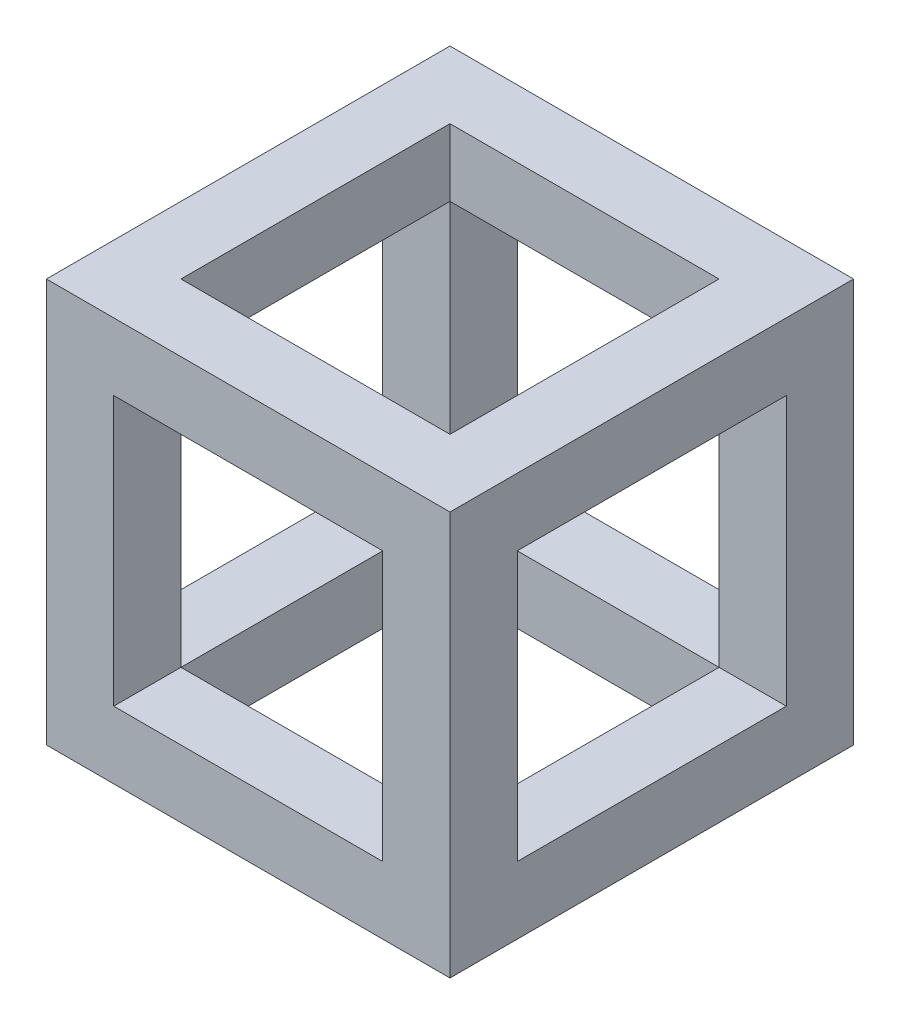
ISO-10303-21;
HEADER;
FILE_DESCRIPTION(('STEP AP214'),'2;1');
FILE_NAME('part.step','',(''),(''),'','','');
FILE_SCHEMA(('AUTOMOTIVE_DESIGN { 1 0 10303 214 1 1 1 1 }'));
ENDSEC;
DATA;
#1=APPLICATION_CONTEXT('core data for automotive mechanical design processes');
#2=APPLICATION_PROTOCOL_DEFINITION('international standard','automotive_design',2000,#1);
#3=PRODUCT_CONTEXT('',#1,'mechanical');
#4=PRODUCT('Part','Part','',(#3));
#5=PRODUCT_RELATED_PRODUCT_CATEGORY('part','',(#4));
#6=PRODUCT_DEFINITION_FORMATION('','',#4);
#7=PRODUCT_DEFINITION_CONTEXT('part definition',#1,'design');
#8=PRODUCT_DEFINITION('design','',#6,#7);
#9=PRODUCT_DEFINITION_SHAPE('','',#8);
#10=(LENGTH_UNIT() NAMED_UNIT(*) SI_UNIT(.MILLI.,.METRE.));
#11=(NAMED_UNIT(*) PLANE_ANGLE_UNIT() SI_UNIT($,.RADIAN.));
#12=(NAMED_UNIT(*) SI_UNIT($,.STERADIAN.) SOLID_ANGLE_UNIT());
#13=UNCERTAINTY_MEASURE_WITH_UNIT(LENGTH_MEASURE(1.E-05),#10,'distance_accuracy_value','');
#14=(GEOMETRIC_REPRESENTATION_CONTEXT(3) GLOBAL_UNCERTAINTY_ASSIGNED_CONTEXT((#13)) GLOBAL_UNIT_ASSIGNED_CONTEXT((#10,
#11,#12)) REPRESENTATION_CONTEXT('',''));
#15=CARTESIAN_POINT('',(0.,0.,0.));
#16=DIRECTION('',(0.,0.,1.));
#17=DIRECTION('',(1.,0.,0.));
#18=AXIS2_PLACEMENT_3D('',#15,#16,#17);
#19=CARTESIAN_POINT('',(5.,0.,5.));
#20=DIRECTION('',(-1.,0.,0.));
#21=DIRECTION('',(0.,0.,1.));
#22=AXIS2_PLACEMENT_3D('',#19,#20,#21);
#23=PLANE('',#22);
#24=DIRECTION('',(0.,0.,1.));
#25=VECTOR('',#24,1.);
#26=CARTESIAN_POINT('',(5.,5.,0.));
#27=LINE('',#26,#25);
#28=CARTESIAN_POINT('',(5.,5.,25.));
#29=VERTEX_POINT('',#28);
#30=CARTESIAN_POINT('',(5.,5.,30.));
#31=VERTEX_POINT('',#30);
#32=EDGE_CURVE('E249',#29,#31,#27,.T.);
#33=ORIENTED_EDGE('',*,*,#32,.F.);
#34=DIRECTION('',(0.,1.,0.));
#35=VECTOR('',#34,1.);
#36=CARTESIAN_POINT('',(5.,0.,25.));
#37=LINE('',#36,#35);
#38=CARTESIAN_POINT('',(5.,25.,25.));
#39=VERTEX_POINT('',#38);
#40=EDGE_CURVE('E180',#29,#39,#37,.T.);
#41=ORIENTED_EDGE('',*,*,#40,.T.);
#42=DIRECTION('',(0.,0.,1.));
#43=VECTOR('',#42,1.);
#44=CARTESIAN_POINT('',(5.,25.,0.));
#45=LINE('',#44,#43);
#46=CARTESIAN_POINT('',(5.,25.,30.));
#47=VERTEX_POINT('',#46);
#48=EDGE_CURVE('E263',#39,#47,#45,.T.);
#49=ORIENTED_EDGE('',*,*,#48,.T.);
#50=DIRECTION('',(0.,-1.,0.));
#51=VECTOR('',#50,1.);
#52=CARTESIAN_POINT('',(5.,5.,30.));
#53=LINE('',#52,#51);
#54=EDGE_CURVE('E235',#47,#31,#53,.T.);
#55=ORIENTED_EDGE('',*,*,#54,.T.);
#56=EDGE_LOOP('',(#33,#41,#49,#55));
#57=FACE_BOUND('',#56,.T.);
#58=ADVANCED_FACE('F33',(#57),#23,.F.);
#59=DIRECTION('',(0.,1.,0.));
#60=VECTOR('',#59,1.);
#61=CARTESIAN_POINT('',(5.,0.,25.));
#62=LINE('',#61,#60);
#63=CARTESIAN_POINT('',(5.,30.,25.));
#64=VERTEX_POINT('',#63);
#65=EDGE_CURVE('E294',#39,#64,#62,.T.);
#66=ORIENTED_EDGE('',*,*,#65,.F.);
#67=DIRECTION('',(0.,0.,-1.));
#68=VECTOR('',#67,1.);
#69=CARTESIAN_POINT('',(5.,25.,5.));
#70=LINE('',#69,#68);
#71=CARTESIAN_POINT('',(5.,25.,5.));
#72=VERTEX_POINT('',#71);
#73=EDGE_CURVE('E232',#39,#72,#70,.T.);
#74=ORIENTED_EDGE('',*,*,#73,.T.);
#75=DIRECTION('',(0.,1.,0.));
#76=VECTOR('',#75,1.);
#77=CARTESIAN_POINT('',(5.,0.,5.));
#78=LINE('',#77,#76);
#79=CARTESIAN_POINT('',(5.,30.,5.));
#80=VERTEX_POINT('',#79);
#81=EDGE_CURVE('E309',#72,#80,#78,.T.);
#82=ORIENTED_EDGE('',*,*,#81,.T.);
#83=DIRECTION('',(0.,0.,1.));
#84=VECTOR('',#83,1.);
#85=CARTESIAN_POINT('',(5.,30.,5.));
#86=LINE('',#85,#84);
#87=EDGE_CURVE('E280',#80,#64,#86,.T.);
#88=ORIENTED_EDGE('',*,*,#87,.T.);
#89=EDGE_LOOP('',(#66,#74,#82,#88));
#90=FACE_BOUND('',#89,.T.);
#91=ADVANCED_FACE('F362',(#90),#23,.F.);
#92=CARTESIAN_POINT('',(5.,25.,0.));
#93=VERTEX_POINT('',#92);
#94=EDGE_CURVE('E259',#93,#72,#45,.T.);
#95=ORIENTED_EDGE('',*,*,#94,.T.);
#96=DIRECTION('',(0.,-1.,0.));
#97=VECTOR('',#96,1.);
#98=CARTESIAN_POINT('',(5.,0.,5.));
#99=LINE('',#98,#97);
#100=CARTESIAN_POINT('',(5.,5.,5.));
#101=VERTEX_POINT('',#100);
#102=EDGE_CURVE('E220',#72,#101,#99,.T.);
#103=ORIENTED_EDGE('',*,*,#102,.T.);
#104=CARTESIAN_POINT('',(5.,5.,0.));
#105=VERTEX_POINT('',#104);
#106=EDGE_CURVE('E272',#105,#101,#27,.T.);
#107=ORIENTED_EDGE('',*,*,#106,.F.);
#108=DIRECTION('',(0.,-1.,0.));
#109=VECTOR('',#108,1.);
#110=CARTESIAN_POINT('',(5.,5.,0.));
#111=LINE('',#110,#109);
#112=EDGE_CURVE('E236',#93,#105,#111,.T.);
#113=ORIENTED_EDGE('',*,*,#112,.F.);
#114=EDGE_LOOP('',(#95,#103,#107,#113));
#115=FACE_BOUND('',#114,.T.);
#116=ADVANCED_FACE('F413',(#115),#23,.F.);
#117=CARTESIAN_POINT('',(25.,0.,5.));
#118=DIRECTION('',(1.,0.,0.));
#119=DIRECTION('',(0.,0.,-1.));
#120=AXIS2_PLACEMENT_3D('',#117,#118,#119);
#121=PLANE('',#120);
#122=DIRECTION('',(0.,0.,1.));
#123=VECTOR('',#122,1.);
#124=CARTESIAN_POINT('',(25.,25.,0.));
#125=LINE('',#124,#123);
#126=CARTESIAN_POINT('',(25.,25.,25.));
#127=VERTEX_POINT('',#126);
#128=CARTESIAN_POINT('',(25.,25.,30.));
#129=VERTEX_POINT('',#128);
#130=EDGE_CURVE('E267',#127,#129,#125,.T.);
#131=ORIENTED_EDGE('',*,*,#130,.F.);
#132=DIRECTION('',(0.,-1.,0.));
#133=VECTOR('',#132,1.);
#134=CARTESIAN_POINT('',(25.,0.,25.));
#135=LINE('',#134,#133);
#136=CARTESIAN_POINT('',(25.,5.,25.));
#137=VERTEX_POINT('',#136);
#138=EDGE_CURVE('E223',#127,#137,#135,.T.);
#139=ORIENTED_EDGE('',*,*,#138,.T.);
#140=DIRECTION('',(0.,0.,1.));
#141=VECTOR('',#140,1.);
#142=CARTESIAN_POINT('',(25.,5.,0.));
#143=LINE('',#142,#141);
#144=CARTESIAN_POINT('',(25.,5.,30.));
#145=VERTEX_POINT('',#144);
#146=EDGE_CURVE('E271',#137,#145,#143,.T.);
#147=ORIENTED_EDGE('',*,*,#146,.T.);
#148=DIRECTION('',(0.,1.,0.));
#149=VECTOR('',#148,1.);
#150=CARTESIAN_POINT('',(25.,5.,30.));
#151=LINE('',#150,#149);
#152=EDGE_CURVE('E254',#145,#129,#151,.T.);
#153=ORIENTED_EDGE('',*,*,#152,.T.);
#154=EDGE_LOOP('',(#131,#139,#147,#153));
#155=FACE_BOUND('',#154,.T.);
#156=ADVANCED_FACE('F426',(#155),#121,.F.);
#157=DIRECTION('',(0.,1.,0.));
#158=VECTOR('',#157,1.);
#159=CARTESIAN_POINT('',(25.,0.,5.));
#160=LINE('',#159,#158);
#161=CARTESIAN_POINT('',(25.,25.,5.));
#162=VERTEX_POINT('',#161);
#163=CARTESIAN_POINT('',(25.,30.,5.));
#164=VERTEX_POINT('',#163);
#165=EDGE_CURVE('E313',#162,#164,#160,.T.);
#166=ORIENTED_EDGE('',*,*,#165,.F.);
#167=DIRECTION('',(0.,0.,1.));
#168=VECTOR('',#167,1.);
#169=CARTESIAN_POINT('',(25.,25.,5.));
#170=LINE('',#169,#168);
#171=EDGE_CURVE('E11',#162,#127,#170,.T.);
#172=ORIENTED_EDGE('',*,*,#171,.T.);
#173=DIRECTION('',(0.,1.,0.));
#174=VECTOR('',#173,1.);
#175=CARTESIAN_POINT('',(25.,0.,25.));
#176=LINE('',#175,#174);
#177=CARTESIAN_POINT('',(25.,30.,25.));
#178=VERTEX_POINT('',#177);
#179=EDGE_CURVE('E317',#127,#178,#176,.T.);
#180=ORIENTED_EDGE('',*,*,#179,.T.);
#181=DIRECTION('',(0.,0.,-1.));
#182=VECTOR('',#181,1.);
#183=CARTESIAN_POINT('',(25.,30.,5.));
#184=LINE('',#183,#182);
#185=EDGE_CURVE('E300',#178,#164,#184,.T.);
#186=ORIENTED_EDGE('',*,*,#185,.T.);
#187=EDGE_LOOP('',(#166,#172,#180,#186));
#188=FACE_BOUND('',#187,.T.);
#189=ADVANCED_FACE('F374',(#188),#121,.F.);
#190=CARTESIAN_POINT('',(25.,5.,0.));
#191=VERTEX_POINT('',#190);
#192=CARTESIAN_POINT('',(25.,5.,5.));
#193=VERTEX_POINT('',#192);
#194=EDGE_CURVE('E268',#191,#193,#143,.T.);
#195=ORIENTED_EDGE('',*,*,#194,.T.);
#196=DIRECTION('',(0.,1.,0.));
#197=VECTOR('',#196,1.);
#198=CARTESIAN_POINT('',(25.,0.,5.));
#199=LINE('',#198,#197);
#200=EDGE_CURVE('E211',#193,#162,#199,.T.);
#201=ORIENTED_EDGE('',*,*,#200,.T.);
#202=CARTESIAN_POINT('',(25.,25.,0.));
#203=VERTEX_POINT('',#202);
#204=EDGE_CURVE('E264',#203,#162,#125,.T.);
#205=ORIENTED_EDGE('',*,*,#204,.F.);
#206=DIRECTION('',(0.,1.,0.));
#207=VECTOR('',#206,1.);
#208=CARTESIAN_POINT('',(25.,5.,0.));
#209=LINE('',#208,#207);
#210=EDGE_CURVE('E243',#191,#203,#209,.T.);
#211=ORIENTED_EDGE('',*,*,#210,.F.);
#212=EDGE_LOOP('',(#195,#201,#205,#211));
#213=FACE_BOUND('',#212,.T.);
#214=ADVANCED_FACE('F385',(#213),#121,.F.);
#215=CARTESIAN_POINT('',(5.,0.,5.));
#216=DIRECTION('',(0.,0.,-1.));
#217=DIRECTION('',(-1.,0.,0.));
#218=AXIS2_PLACEMENT_3D('',#215,#216,#217);
#219=PLANE('',#218);
#220=ORIENTED_EDGE('',*,*,#81,.F.);
#221=DIRECTION('',(1.,0.,0.));
#222=VECTOR('',#221,1.);
#223=CARTESIAN_POINT('',(5.,25.,5.));
#224=LINE('',#223,#222);
#225=EDGE_CURVE('E277',#72,#162,#224,.T.);
#226=ORIENTED_EDGE('',*,*,#225,.T.);
#227=ORIENTED_EDGE('',*,*,#165,.T.);
#228=DIRECTION('',(-1.,0.,0.));
#229=VECTOR('',#228,1.);
#230=CARTESIAN_POINT('',(5.,30.,5.));
#231=LINE('',#230,#229);
#232=EDGE_CURVE('E285',#164,#80,#231,.T.);
#233=ORIENTED_EDGE('',*,*,#232,.T.);
#234=EDGE_LOOP('',(#220,#226,#227,#233));
#235=FACE_BOUND('',#234,.T.);
#236=ADVANCED_FACE('F391',(#235),#219,.F.);
#237=CARTESIAN_POINT('',(5.,0.,25.));
#238=DIRECTION('',(0.,0.,1.));
#239=DIRECTION('',(1.,0.,0.));
#240=AXIS2_PLACEMENT_3D('',#237,#238,#239);
#241=PLANE('',#240);
#242=ORIENTED_EDGE('',*,*,#179,.F.);
#243=DIRECTION('',(-1.,0.,0.));
#244=VECTOR('',#243,1.);
#245=CARTESIAN_POINT('',(5.,25.,25.));
#246=LINE('',#245,#244);
#247=EDGE_CURVE('E41',#127,#39,#246,.T.);
#248=ORIENTED_EDGE('',*,*,#247,.T.);
#249=ORIENTED_EDGE('',*,*,#65,.T.);
#250=DIRECTION('',(1.,0.,0.));
#251=VECTOR('',#250,1.);
#252=CARTESIAN_POINT('',(5.,30.,25.));
#253=LINE('',#252,#251);
#254=EDGE_CURVE('E297',#64,#178,#253,.T.);
#255=ORIENTED_EDGE('',*,*,#254,.T.);
#256=EDGE_LOOP('',(#242,#248,#249,#255));
#257=FACE_BOUND('',#256,.T.);
#258=ADVANCED_FACE('F357',(#257),#241,.F.);
#259=CARTESIAN_POINT('',(0.,0.,30.));
#260=DIRECTION('',(1.,0.,0.));
#261=DIRECTION('',(0.,0.,-1.));
#262=AXIS2_PLACEMENT_3D('',#259,#260,#261);
#263=PLANE('',#262);
#264=DIRECTION('',(0.,0.,1.));
#265=VECTOR('',#264,1.);
#266=CARTESIAN_POINT('',(0.,25.,25.));
#267=LINE('',#266,#265);
#268=CARTESIAN_POINT('',(0.,25.,5.));
#269=VERTEX_POINT('',#268);
#270=CARTESIAN_POINT('',(0.,25.,25.));
#271=VERTEX_POINT('',#270);
#272=EDGE_CURVE('E194',#269,#271,#267,.T.);
#273=ORIENTED_EDGE('',*,*,#272,.T.);
#274=DIRECTION('',(0.,-1.,0.));
#275=VECTOR('',#274,1.);
#276=CARTESIAN_POINT('',(0.,5.,25.));
#277=LINE('',#276,#275);
#278=CARTESIAN_POINT('',(0.,5.,25.));
#279=VERTEX_POINT('',#278);
#280=EDGE_CURVE('E177',#271,#279,#277,.T.);
#281=ORIENTED_EDGE('',*,*,#280,.T.);
#282=DIRECTION('',(0.,0.,-1.));
#283=VECTOR('',#282,1.);
#284=CARTESIAN_POINT('',(0.,5.,25.));
#285=LINE('',#284,#283);
#286=CARTESIAN_POINT('',(0.,5.,5.));
#287=VERTEX_POINT('',#286);
#288=EDGE_CURVE('E187',#279,#287,#285,.T.);
#289=ORIENTED_EDGE('',*,*,#288,.T.);
#290=DIRECTION('',(0.,1.,0.));
#291=VECTOR('',#290,1.);
#292=CARTESIAN_POINT('',(0.,5.,5.));
#293=LINE('',#292,#291);
#294=EDGE_CURVE('E48',#287,#269,#293,.T.);
#295=ORIENTED_EDGE('',*,*,#294,.T.);
#296=EDGE_LOOP('',(#273,#281,#289,#295));
#297=FACE_BOUND('',#296,.T.);
#298=DIRECTION('',(0.,-1.,0.));
#299=VECTOR('',#298,1.);
#300=CARTESIAN_POINT('',(0.,0.,0.));
#301=LINE('',#300,#299);
#302=CARTESIAN_POINT('',(0.,30.,0.));
#303=VERTEX_POINT('',#302);
#304=CARTESIAN_POINT('',(0.,0.,0.));
#305=VERTEX_POINT('',#304);
#306=EDGE_CURVE('E308',#303,#305,#301,.T.);
#307=ORIENTED_EDGE('',*,*,#306,.T.);
#308=DIRECTION('',(0.,0.,-1.));
#309=VECTOR('',#308,1.);
#310=CARTESIAN_POINT('',(0.,0.,30.));
#311=LINE('',#310,#309);
#312=CARTESIAN_POINT('',(0.,0.,30.));
#313=VERTEX_POINT('',#312);
#314=EDGE_CURVE('E347',#313,#305,#311,.T.);
#315=ORIENTED_EDGE('',*,*,#314,.F.);
#316=DIRECTION('',(0.,-1.,0.));
#317=VECTOR('',#316,1.);
#318=CARTESIAN_POINT('',(0.,0.,30.));
#319=LINE('',#318,#317);
#320=CARTESIAN_POINT('',(0.,30.,30.));
#321=VERTEX_POINT('',#320);
#322=EDGE_CURVE('E321',#321,#313,#319,.T.);
#323=ORIENTED_EDGE('',*,*,#322,.F.);
#324=DIRECTION('',(0.,0.,-1.));
#325=VECTOR('',#324,1.);
#326=CARTESIAN_POINT('',(0.,30.,30.));
#327=LINE('',#326,#325);
#328=EDGE_CURVE('E331',#321,#303,#327,.T.);
#329=ORIENTED_EDGE('',*,*,#328,.T.);
#330=EDGE_LOOP('',(#307,#315,#323,#329));
#331=FACE_BOUND('',#330,.T.);
#332=ADVANCED_FACE('F35',(#297,#331),#263,.F.);
#333=CARTESIAN_POINT('',(0.,0.,30.));
#334=DIRECTION('',(0.,1.,0.));
#335=DIRECTION('',(0.,0.,1.));
#336=AXIS2_PLACEMENT_3D('',#333,#334,#335);
#337=PLANE('',#336);
#338=DIRECTION('',(-1.,0.,0.));
#339=VECTOR('',#338,1.);
#340=CARTESIAN_POINT('',(5.,0.,5.));
#341=LINE('',#340,#339);
#342=CARTESIAN_POINT('',(25.,0.,5.));
#343=VERTEX_POINT('',#342);
#344=CARTESIAN_POINT('',(5.,0.,5.));
#345=VERTEX_POINT('',#344);
#346=EDGE_CURVE('E291',#343,#345,#341,.T.);
#347=ORIENTED_EDGE('',*,*,#346,.T.);
#348=DIRECTION('',(0.,0.,1.));
#349=VECTOR('',#348,1.);
#350=CARTESIAN_POINT('',(5.,0.,5.));
#351=LINE('',#350,#349);
#352=CARTESIAN_POINT('',(5.,0.,25.));
#353=VERTEX_POINT('',#352);
#354=EDGE_CURVE('E281',#345,#353,#351,.T.);
#355=ORIENTED_EDGE('',*,*,#354,.T.);
#356=DIRECTION('',(1.,0.,0.));
#357=VECTOR('',#356,1.);
#358=CARTESIAN_POINT('',(5.,0.,25.));
#359=LINE('',#358,#357);
#360=CARTESIAN_POINT('',(25.,0.,25.));
#361=VERTEX_POINT('',#360);
#362=EDGE_CURVE('E284',#353,#361,#359,.T.);
#363=ORIENTED_EDGE('',*,*,#362,.T.);
#364=DIRECTION('',(0.,0.,-1.));
#365=VECTOR('',#364,1.);
#366=CARTESIAN_POINT('',(25.,0.,5.));
#367=LINE('',#366,#365);
#368=EDGE_CURVE('E288',#361,#343,#367,.T.);
#369=ORIENTED_EDGE('',*,*,#368,.T.);
#370=EDGE_LOOP('',(#347,#355,#363,#369));
#371=FACE_BOUND('',#370,.T.);
#372=DIRECTION('',(1.,0.,0.));
#373=VECTOR('',#372,1.);
#374=CARTESIAN_POINT('',(0.,0.,0.));
#375=LINE('',#374,#373);
#376=CARTESIAN_POINT('',(30.,0.,0.));
#377=VERTEX_POINT('',#376);
#378=EDGE_CURVE('E334',#305,#377,#375,.T.);
#379=ORIENTED_EDGE('',*,*,#378,.T.);
#380=DIRECTION('',(0.,0.,-1.));
#381=VECTOR('',#380,1.);
#382=CARTESIAN_POINT('',(30.,0.,30.));
#383=LINE('',#382,#381);
#384=CARTESIAN_POINT('',(30.,0.,30.));
#385=VERTEX_POINT('',#384);
#386=EDGE_CURVE('E344',#385,#377,#383,.T.);
#387=ORIENTED_EDGE('',*,*,#386,.F.);
#388=DIRECTION('',(1.,0.,0.));
#389=VECTOR('',#388,1.);
#390=CARTESIAN_POINT('',(0.,0.,30.));
#391=LINE('',#390,#389);
#392=EDGE_CURVE('E324',#313,#385,#391,.T.);
#393=ORIENTED_EDGE('',*,*,#392,.F.);
#394=ORIENTED_EDGE('',*,*,#314,.T.);
#395=EDGE_LOOP('',(#379,#387,#393,#394));
#396=FACE_BOUND('',#395,.T.);
#397=ADVANCED_FACE('F443',(#371,#396),#337,.F.);
#398=CARTESIAN_POINT('',(30.,0.,30.));
#399=DIRECTION('',(-1.,0.,0.));
#400=DIRECTION('',(0.,0.,1.));
#401=AXIS2_PLACEMENT_3D('',#398,#399,#400);
#402=PLANE('',#401);
#403=DIRECTION('',(0.,0.,-1.));
#404=VECTOR('',#403,1.);
#405=CARTESIAN_POINT('',(30.,5.,25.));
#406=LINE('',#405,#404);
#407=CARTESIAN_POINT('',(30.,5.,25.));
#408=VERTEX_POINT('',#407);
#409=CARTESIAN_POINT('',(30.,5.,5.));
#410=VERTEX_POINT('',#409);
#411=EDGE_CURVE('E204',#408,#410,#406,.T.);
#412=ORIENTED_EDGE('',*,*,#411,.F.);
#413=DIRECTION('',(0.,-1.,0.));
#414=VECTOR('',#413,1.);
#415=CARTESIAN_POINT('',(30.,5.,25.));
#416=LINE('',#415,#414);
#417=CARTESIAN_POINT('',(30.,25.,25.));
#418=VERTEX_POINT('',#417);
#419=EDGE_CURVE('E56',#418,#408,#416,.T.);
#420=ORIENTED_EDGE('',*,*,#419,.F.);
#421=DIRECTION('',(0.,0.,1.));
#422=VECTOR('',#421,1.);
#423=CARTESIAN_POINT('',(30.,25.,25.));
#424=LINE('',#423,#422);
#425=CARTESIAN_POINT('',(30.,25.,5.));
#426=VERTEX_POINT('',#425);
#427=EDGE_CURVE('E195',#426,#418,#424,.T.);
#428=ORIENTED_EDGE('',*,*,#427,.F.);
#429=DIRECTION('',(0.,1.,0.));
#430=VECTOR('',#429,1.);
#431=CARTESIAN_POINT('',(30.,5.,5.));
#432=LINE('',#431,#430);
#433=EDGE_CURVE('E198',#410,#426,#432,.T.);
#434=ORIENTED_EDGE('',*,*,#433,.F.);
#435=EDGE_LOOP('',(#412,#420,#428,#434));
#436=FACE_BOUND('',#435,.T.);
#437=DIRECTION('',(0.,1.,0.));
#438=VECTOR('',#437,1.);
#439=CARTESIAN_POINT('',(30.,0.,0.));
#440=LINE('',#439,#438);
#441=CARTESIAN_POINT('',(30.,30.,0.));
#442=VERTEX_POINT('',#441);
#443=EDGE_CURVE('E336',#377,#442,#440,.T.);
#444=ORIENTED_EDGE('',*,*,#443,.T.);
#445=DIRECTION('',(0.,0.,-1.));
#446=VECTOR('',#445,1.);
#447=CARTESIAN_POINT('',(30.,30.,30.));
#448=LINE('',#447,#446);
#449=CARTESIAN_POINT('',(30.,30.,30.));
#450=VERTEX_POINT('',#449);
#451=EDGE_CURVE('E341',#450,#442,#448,.T.);
#452=ORIENTED_EDGE('',*,*,#451,.F.);
#453=DIRECTION('',(0.,1.,0.));
#454=VECTOR('',#453,1.);
#455=CARTESIAN_POINT('',(30.,0.,30.));
#456=LINE('',#455,#454);
#457=EDGE_CURVE('E327',#385,#450,#456,.T.);
#458=ORIENTED_EDGE('',*,*,#457,.F.);
#459=ORIENTED_EDGE('',*,*,#386,.T.);
#460=EDGE_LOOP('',(#444,#452,#458,#459));
#461=FACE_BOUND('',#460,.T.);
#462=ADVANCED_FACE('F463',(#436,#461),#402,.F.);
#463=CARTESIAN_POINT('',(0.,30.,30.));
#464=DIRECTION('',(0.,-1.,0.));
#465=DIRECTION('',(0.,0.,-1.));
#466=AXIS2_PLACEMENT_3D('',#463,#464,#465);
#467=PLANE('',#466);
#468=ORIENTED_EDGE('',*,*,#254,.F.);
#469=ORIENTED_EDGE('',*,*,#87,.F.);
#470=ORIENTED_EDGE('',*,*,#232,.F.);
#471=ORIENTED_EDGE('',*,*,#185,.F.);
#472=EDGE_LOOP('',(#468,#469,#470,#471));
#473=FACE_BOUND('',#472,.T.);
#474=DIRECTION('',(-1.,0.,0.));
#475=VECTOR('',#474,1.);
#476=CARTESIAN_POINT('',(0.,30.,0.));
#477=LINE('',#476,#475);
#478=EDGE_CURVE('E325',#442,#303,#477,.T.);
#479=ORIENTED_EDGE('',*,*,#478,.T.);
#480=ORIENTED_EDGE('',*,*,#328,.F.);
#481=DIRECTION('',(-1.,0.,0.));
#482=VECTOR('',#481,1.);
#483=CARTESIAN_POINT('',(0.,30.,30.));
#484=LINE('',#483,#482);
#485=EDGE_CURVE('E329',#450,#321,#484,.T.);
#486=ORIENTED_EDGE('',*,*,#485,.F.);
#487=ORIENTED_EDGE('',*,*,#451,.T.);
#488=EDGE_LOOP('',(#479,#480,#486,#487));
#489=FACE_BOUND('',#488,.T.);
#490=ADVANCED_FACE('F370',(#473,#489),#467,.F.);
#491=CARTESIAN_POINT('',(0.,0.,30.));
#492=DIRECTION('',(0.,0.,-1.));
#493=DIRECTION('',(-1.,0.,0.));
#494=AXIS2_PLACEMENT_3D('',#491,#492,#493);
#495=PLANE('',#494);
#496=DIRECTION('',(1.,0.,0.));
#497=VECTOR('',#496,1.);
#498=CARTESIAN_POINT('',(5.,5.,30.));
#499=LINE('',#498,#497);
#500=EDGE_CURVE('E251',#31,#145,#499,.T.);
#501=ORIENTED_EDGE('',*,*,#500,.F.);
#502=ORIENTED_EDGE('',*,*,#54,.F.);
#503=DIRECTION('',(-1.,0.,0.));
#504=VECTOR('',#503,1.);
#505=CARTESIAN_POINT('',(5.,25.,30.));
#506=LINE('',#505,#504);
#507=EDGE_CURVE('E240',#129,#47,#506,.T.);
#508=ORIENTED_EDGE('',*,*,#507,.F.);
#509=ORIENTED_EDGE('',*,*,#152,.F.);
#510=EDGE_LOOP('',(#501,#502,#508,#509));
#511=FACE_BOUND('',#510,.T.);
#512=ORIENTED_EDGE('',*,*,#322,.T.);
#513=ORIENTED_EDGE('',*,*,#392,.T.);
#514=ORIENTED_EDGE('',*,*,#457,.T.);
#515=ORIENTED_EDGE('',*,*,#485,.T.);
#516=EDGE_LOOP('',(#512,#513,#514,#515));
#517=FACE_BOUND('',#516,.T.);
#518=ADVANCED_FACE('F422',(#511,#517),#495,.F.);
#519=CARTESIAN_POINT('',(0.,0.,0.));
#520=DIRECTION('',(0.,0.,-1.));
#521=DIRECTION('',(-1.,0.,0.));
#522=AXIS2_PLACEMENT_3D('',#519,#520,#521);
#523=PLANE('',#522);
#524=ORIENTED_EDGE('',*,*,#112,.T.);
#525=DIRECTION('',(1.,0.,0.));
#526=VECTOR('',#525,1.);
#527=CARTESIAN_POINT('',(5.,5.,0.));
#528=LINE('',#527,#526);
#529=EDGE_CURVE('E239',#105,#191,#528,.T.);
#530=ORIENTED_EDGE('',*,*,#529,.T.);
#531=ORIENTED_EDGE('',*,*,#210,.T.);
#532=DIRECTION('',(-1.,0.,0.));
#533=VECTOR('',#532,1.);
#534=CARTESIAN_POINT('',(5.,25.,0.));
#535=LINE('',#534,#533);
#536=EDGE_CURVE('E246',#203,#93,#535,.T.);
#537=ORIENTED_EDGE('',*,*,#536,.T.);
#538=EDGE_LOOP('',(#524,#530,#531,#537));
#539=FACE_BOUND('',#538,.T.);
#540=ORIENTED_EDGE('',*,*,#306,.F.);
#541=ORIENTED_EDGE('',*,*,#478,.F.);
#542=ORIENTED_EDGE('',*,*,#443,.F.);
#543=ORIENTED_EDGE('',*,*,#378,.F.);
#544=EDGE_LOOP('',(#540,#541,#542,#543));
#545=FACE_BOUND('',#544,.T.);
#546=ADVANCED_FACE('F417',(#539,#545),#523,.T.);
#547=EDGE_CURVE('E305',#345,#101,#78,.T.);
#548=ORIENTED_EDGE('',*,*,#547,.T.);
#549=DIRECTION('',(0.,0.,1.));
#550=VECTOR('',#549,1.);
#551=CARTESIAN_POINT('',(5.,5.,5.));
#552=LINE('',#551,#550);
#553=EDGE_CURVE('E230',#101,#29,#552,.T.);
#554=ORIENTED_EDGE('',*,*,#553,.T.);
#555=EDGE_CURVE('E318',#353,#29,#62,.T.);
#556=ORIENTED_EDGE('',*,*,#555,.F.);
#557=ORIENTED_EDGE('',*,*,#354,.F.);
#558=EDGE_LOOP('',(#548,#554,#556,#557));
#559=FACE_BOUND('',#558,.T.);
#560=ADVANCED_FACE('F405',(#559),#23,.F.);
#561=EDGE_CURVE('E310',#343,#193,#160,.T.);
#562=ORIENTED_EDGE('',*,*,#561,.T.);
#563=DIRECTION('',(-1.,0.,0.));
#564=VECTOR('',#563,1.);
#565=CARTESIAN_POINT('',(5.,5.,5.));
#566=LINE('',#565,#564);
#567=EDGE_CURVE('E262',#193,#101,#566,.T.);
#568=ORIENTED_EDGE('',*,*,#567,.T.);
#569=ORIENTED_EDGE('',*,*,#547,.F.);
#570=ORIENTED_EDGE('',*,*,#346,.F.);
#571=EDGE_LOOP('',(#562,#568,#569,#570));
#572=FACE_BOUND('',#571,.T.);
#573=ADVANCED_FACE('F394',(#572),#219,.F.);
#574=EDGE_CURVE('E314',#361,#137,#176,.T.);
#575=ORIENTED_EDGE('',*,*,#574,.T.);
#576=DIRECTION('',(0.,0.,-1.));
#577=VECTOR('',#576,1.);
#578=CARTESIAN_POINT('',(25.,5.,5.));
#579=LINE('',#578,#577);
#580=EDGE_CURVE('E227',#137,#193,#579,.T.);
#581=ORIENTED_EDGE('',*,*,#580,.T.);
#582=ORIENTED_EDGE('',*,*,#561,.F.);
#583=ORIENTED_EDGE('',*,*,#368,.F.);
#584=EDGE_LOOP('',(#575,#581,#582,#583));
#585=FACE_BOUND('',#584,.T.);
#586=ADVANCED_FACE('F402',(#585),#121,.F.);
#587=ORIENTED_EDGE('',*,*,#555,.T.);
#588=DIRECTION('',(1.,0.,0.));
#589=VECTOR('',#588,1.);
#590=CARTESIAN_POINT('',(5.,5.,25.));
#591=LINE('',#590,#589);
#592=EDGE_CURVE('E350',#29,#137,#591,.T.);
#593=ORIENTED_EDGE('',*,*,#592,.T.);
#594=ORIENTED_EDGE('',*,*,#574,.F.);
#595=ORIENTED_EDGE('',*,*,#362,.F.);
#596=EDGE_LOOP('',(#587,#593,#594,#595));
#597=FACE_BOUND('',#596,.T.);
#598=ADVANCED_FACE('F400',(#597),#241,.F.);
#599=CARTESIAN_POINT('',(5.,5.,0.));
#600=DIRECTION('',(0.,-1.,0.));
#601=DIRECTION('',(0.,0.,-1.));
#602=AXIS2_PLACEMENT_3D('',#599,#600,#601);
#603=PLANE('',#602);
#604=ORIENTED_EDGE('',*,*,#32,.T.);
#605=ORIENTED_EDGE('',*,*,#500,.T.);
#606=ORIENTED_EDGE('',*,*,#146,.F.);
#607=ORIENTED_EDGE('',*,*,#592,.F.);
#608=EDGE_LOOP('',(#604,#605,#606,#607));
#609=FACE_BOUND('',#608,.T.);
#610=ADVANCED_FACE('F451',(#609),#603,.F.);
#611=CARTESIAN_POINT('',(5.,25.,0.));
#612=DIRECTION('',(0.,1.,0.));
#613=DIRECTION('',(0.,0.,1.));
#614=AXIS2_PLACEMENT_3D('',#611,#612,#613);
#615=PLANE('',#614);
#616=ORIENTED_EDGE('',*,*,#130,.T.);
#617=ORIENTED_EDGE('',*,*,#507,.T.);
#618=ORIENTED_EDGE('',*,*,#48,.F.);
#619=ORIENTED_EDGE('',*,*,#247,.F.);
#620=EDGE_LOOP('',(#616,#617,#618,#619));
#621=FACE_BOUND('',#620,.T.);
#622=ADVANCED_FACE('F591',(#621),#615,.F.);
#623=ORIENTED_EDGE('',*,*,#94,.F.);
#624=ORIENTED_EDGE('',*,*,#536,.F.);
#625=ORIENTED_EDGE('',*,*,#204,.T.);
#626=ORIENTED_EDGE('',*,*,#225,.F.);
#627=EDGE_LOOP('',(#623,#624,#625,#626));
#628=FACE_BOUND('',#627,.T.);
#629=ADVANCED_FACE('F389',(#628),#615,.F.);
#630=ORIENTED_EDGE('',*,*,#194,.F.);
#631=ORIENTED_EDGE('',*,*,#529,.F.);
#632=ORIENTED_EDGE('',*,*,#106,.T.);
#633=ORIENTED_EDGE('',*,*,#567,.F.);
#634=EDGE_LOOP('',(#630,#631,#632,#633));
#635=FACE_BOUND('',#634,.T.);
#636=ADVANCED_FACE('F437',(#635),#603,.F.);
#637=CARTESIAN_POINT('',(0.,5.,25.));
#638=DIRECTION('',(0.,-1.,0.));
#639=DIRECTION('',(0.,0.,-1.));
#640=AXIS2_PLACEMENT_3D('',#637,#638,#639);
#641=PLANE('',#640);
#642=DIRECTION('',(1.,0.,0.));
#643=VECTOR('',#642,1.);
#644=CARTESIAN_POINT('',(0.,5.,25.));
#645=LINE('',#644,#643);
#646=EDGE_CURVE('E184',#137,#408,#645,.T.);
#647=ORIENTED_EDGE('',*,*,#646,.T.);
#648=ORIENTED_EDGE('',*,*,#411,.T.);
#649=DIRECTION('',(1.,0.,0.));
#650=VECTOR('',#649,1.);
#651=CARTESIAN_POINT('',(0.,5.,5.));
#652=LINE('',#651,#650);
#653=EDGE_CURVE('E183',#193,#410,#652,.T.);
#654=ORIENTED_EDGE('',*,*,#653,.F.);
#655=ORIENTED_EDGE('',*,*,#580,.F.);
#656=EDGE_LOOP('',(#647,#648,#654,#655));
#657=FACE_BOUND('',#656,.T.);
#658=ADVANCED_FACE('F461',(#657),#641,.F.);
#659=CARTESIAN_POINT('',(0.,5.,5.));
#660=DIRECTION('',(0.,0.,-1.));
#661=DIRECTION('',(-1.,0.,0.));
#662=AXIS2_PLACEMENT_3D('',#659,#660,#661);
#663=PLANE('',#662);
#664=ORIENTED_EDGE('',*,*,#653,.T.);
#665=ORIENTED_EDGE('',*,*,#433,.T.);
#666=DIRECTION('',(1.,0.,0.));
#667=VECTOR('',#666,1.);
#668=CARTESIAN_POINT('',(0.,25.,5.));
#669=LINE('',#668,#667);
#670=EDGE_CURVE('E216',#162,#426,#669,.T.);
#671=ORIENTED_EDGE('',*,*,#670,.F.);
#672=ORIENTED_EDGE('',*,*,#200,.F.);
#673=EDGE_LOOP('',(#664,#665,#671,#672));
#674=FACE_BOUND('',#673,.T.);
#675=ADVANCED_FACE('F381',(#674),#663,.F.);
#676=CARTESIAN_POINT('',(0.,25.,25.));
#677=DIRECTION('',(0.,1.,0.));
#678=DIRECTION('',(0.,0.,1.));
#679=AXIS2_PLACEMENT_3D('',#676,#677,#678);
#680=PLANE('',#679);
#681=ORIENTED_EDGE('',*,*,#670,.T.);
#682=ORIENTED_EDGE('',*,*,#427,.T.);
#683=DIRECTION('',(1.,0.,0.));
#684=VECTOR('',#683,1.);
#685=CARTESIAN_POINT('',(0.,25.,25.));
#686=LINE('',#685,#684);
#687=EDGE_CURVE('E212',#127,#418,#686,.T.);
#688=ORIENTED_EDGE('',*,*,#687,.F.);
#689=ORIENTED_EDGE('',*,*,#171,.F.);
#690=EDGE_LOOP('',(#681,#682,#688,#689));
#691=FACE_BOUND('',#690,.T.);
#692=ADVANCED_FACE('F378',(#691),#680,.F.);
#693=CARTESIAN_POINT('',(0.,5.,25.));
#694=DIRECTION('',(0.,0.,1.));
#695=DIRECTION('',(1.,0.,0.));
#696=AXIS2_PLACEMENT_3D('',#693,#694,#695);
#697=PLANE('',#696);
#698=ORIENTED_EDGE('',*,*,#687,.T.);
#699=ORIENTED_EDGE('',*,*,#419,.T.);
#700=ORIENTED_EDGE('',*,*,#646,.F.);
#701=ORIENTED_EDGE('',*,*,#138,.F.);
#702=EDGE_LOOP('',(#698,#699,#700,#701));
#703=FACE_BOUND('',#702,.T.);
#704=ADVANCED_FACE('F458',(#703),#697,.F.);
#705=EDGE_CURVE('E209',#271,#39,#686,.T.);
#706=ORIENTED_EDGE('',*,*,#705,.F.);
#707=ORIENTED_EDGE('',*,*,#272,.F.);
#708=EDGE_CURVE('E213',#269,#72,#669,.T.);
#709=ORIENTED_EDGE('',*,*,#708,.T.);
#710=ORIENTED_EDGE('',*,*,#73,.F.);
#711=EDGE_LOOP('',(#706,#707,#709,#710));
#712=FACE_BOUND('',#711,.T.);
#713=ADVANCED_FACE('F638',(#712),#680,.F.);
#714=EDGE_CURVE('E189',#287,#101,#652,.T.);
#715=ORIENTED_EDGE('',*,*,#714,.F.);
#716=ORIENTED_EDGE('',*,*,#288,.F.);
#717=EDGE_CURVE('E172',#279,#29,#645,.T.);
#718=ORIENTED_EDGE('',*,*,#717,.T.);
#719=ORIENTED_EDGE('',*,*,#553,.F.);
#720=EDGE_LOOP('',(#715,#716,#718,#719));
#721=FACE_BOUND('',#720,.T.);
#722=ADVANCED_FACE('F188',(#721),#641,.F.);
#723=ORIENTED_EDGE('',*,*,#717,.F.);
#724=ORIENTED_EDGE('',*,*,#280,.F.);
#725=ORIENTED_EDGE('',*,*,#705,.T.);
#726=ORIENTED_EDGE('',*,*,#40,.F.);
#727=EDGE_LOOP('',(#723,#724,#725,#726));
#728=FACE_BOUND('',#727,.T.);
#729=ADVANCED_FACE('F174',(#728),#697,.F.);
#730=ORIENTED_EDGE('',*,*,#708,.F.);
#731=ORIENTED_EDGE('',*,*,#294,.F.);
#732=ORIENTED_EDGE('',*,*,#714,.T.);
#733=ORIENTED_EDGE('',*,*,#102,.F.);
#734=EDGE_LOOP('',(#730,#731,#732,#733));
#735=FACE_BOUND('',#734,.T.);
#736=ADVANCED_FACE('F629',(#735),#663,.F.);
#737=CLOSED_SHELL('',(#58,#91,#116,#156,#189,#214,#236,#258,#332,#397,#462,#490,#518,#546,#560,
#573,#586,#598,#610,#622,#629,#636,#658,#675,#692,#704,#713,#722,#729,#736));
#738=MANIFOLD_SOLID_BREP('B2',#737);
#739=ADVANCED_BREP_SHAPE_REPRESENTATION('',(#18,#738),#14);
#740=SHAPE_DEFINITION_REPRESENTATION(#9,#739);
ENDSEC;
END-ISO-10303-21;
